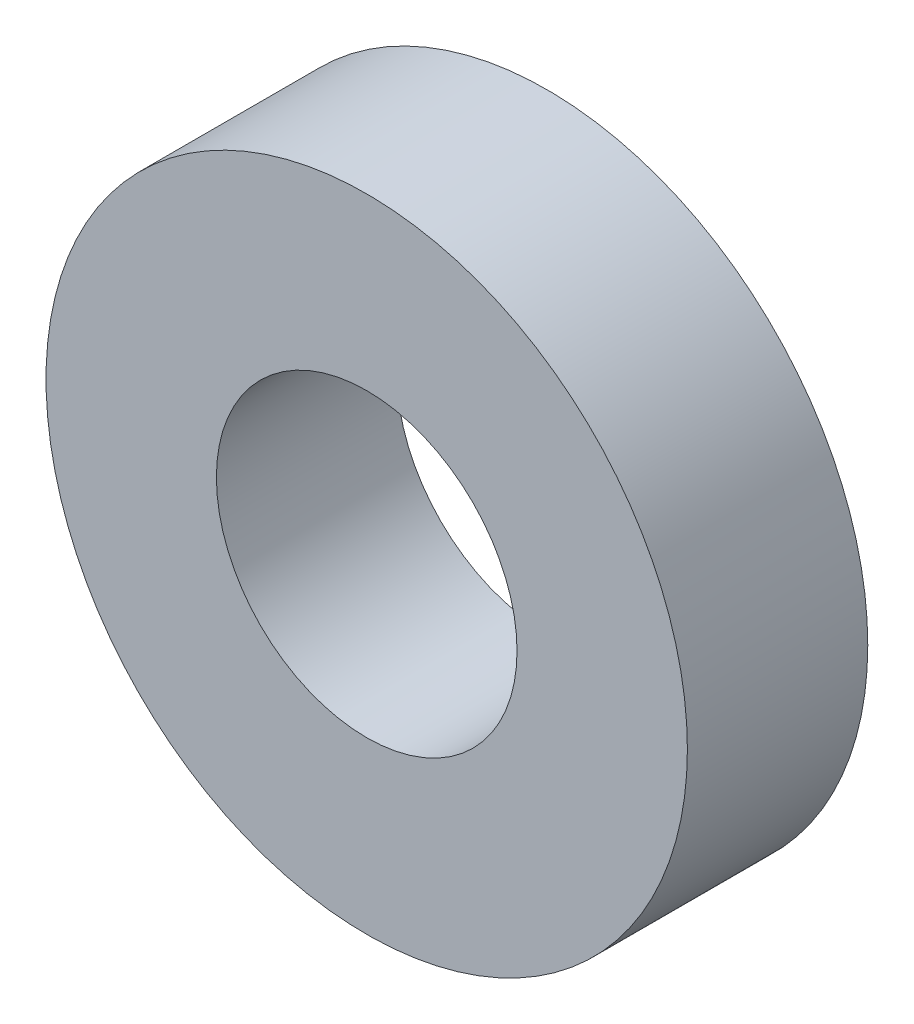
ISO-10303-21;
HEADER;
FILE_DESCRIPTION(('STEP AP214'),'2;1');
FILE_NAME('part.step','',(''),(''),'','','');
FILE_SCHEMA(('AUTOMOTIVE_DESIGN { 1 0 10303 214 1 1 1 1 }'));
ENDSEC;
DATA;
#1=APPLICATION_CONTEXT('core data for automotive mechanical design processes');
#2=APPLICATION_PROTOCOL_DEFINITION('international standard','automotive_design',2000,#1);
#3=PRODUCT_CONTEXT('',#1,'mechanical');
#4=PRODUCT('Part','Part','',(#3));
#5=PRODUCT_RELATED_PRODUCT_CATEGORY('part','',(#4));
#6=PRODUCT_DEFINITION_FORMATION('','',#4);
#7=PRODUCT_DEFINITION_CONTEXT('part definition',#1,'design');
#8=PRODUCT_DEFINITION('design','',#6,#7);
#9=PRODUCT_DEFINITION_SHAPE('','',#8);
#10=(LENGTH_UNIT() NAMED_UNIT(*) SI_UNIT(.MILLI.,.METRE.));
#11=(NAMED_UNIT(*) PLANE_ANGLE_UNIT() SI_UNIT($,.RADIAN.));
#12=(NAMED_UNIT(*) SI_UNIT($,.STERADIAN.) SOLID_ANGLE_UNIT());
#13=UNCERTAINTY_MEASURE_WITH_UNIT(LENGTH_MEASURE(1.E-05),#10,'distance_accuracy_value','');
#14=(GEOMETRIC_REPRESENTATION_CONTEXT(3) GLOBAL_UNCERTAINTY_ASSIGNED_CONTEXT((#13)) GLOBAL_UNIT_ASSIGNED_CONTEXT((#10,
#11,#12)) REPRESENTATION_CONTEXT('',''));
#15=CARTESIAN_POINT('',(0.,0.,0.));
#16=DIRECTION('',(0.,0.,1.));
#17=DIRECTION('',(1.,0.,0.));
#18=AXIS2_PLACEMENT_3D('',#15,#16,#17);
#19=CARTESIAN_POINT('',(0.,0.,9.));
#20=DIRECTION('',(0.,0.,-1.));
#21=DIRECTION('',(-1.,0.,0.));
#22=AXIS2_PLACEMENT_3D('',#19,#20,#21);
#23=CYLINDRICAL_SURFACE('',#22,16.);
#24=CARTESIAN_POINT('',(0.,0.,9.));
#25=DIRECTION('',(0.,0.,1.));
#26=DIRECTION('',(1.,0.,0.));
#27=AXIS2_PLACEMENT_3D('',#24,#25,#26);
#28=CIRCLE('',#27,16.);
#29=CARTESIAN_POINT('',(16.,0.,9.));
#30=VERTEX_POINT('',#29);
#31=EDGE_CURVE('E10',#30,#30,#28,.T.);
#32=ORIENTED_EDGE('',*,*,#31,.F.);
#33=EDGE_LOOP('',(#32));
#34=FACE_BOUND('',#33,.T.);
#35=CARTESIAN_POINT('',(0.,0.,0.));
#36=DIRECTION('',(0.,0.,1.));
#37=DIRECTION('',(1.,0.,0.));
#38=AXIS2_PLACEMENT_3D('',#35,#36,#37);
#39=CIRCLE('',#38,16.);
#40=CARTESIAN_POINT('',(16.,0.,0.));
#41=VERTEX_POINT('',#40);
#42=EDGE_CURVE('E33',#41,#41,#39,.T.);
#43=ORIENTED_EDGE('',*,*,#42,.T.);
#44=EDGE_LOOP('',(#43));
#45=FACE_BOUND('',#44,.T.);
#46=ADVANCED_FACE('F30',(#34,#45),#23,.T.);
#47=CARTESIAN_POINT('',(0.,0.,9.));
#48=DIRECTION('',(0.,0.,1.));
#49=DIRECTION('',(1.,0.,0.));
#50=AXIS2_PLACEMENT_3D('',#47,#48,#49);
#51=PLANE('',#50);
#52=CARTESIAN_POINT('',(0.,0.,9.));
#53=DIRECTION('',(0.,0.,1.));
#54=DIRECTION('',(1.,0.,0.));
#55=AXIS2_PLACEMENT_3D('',#52,#53,#54);
#56=CIRCLE('',#55,7.5);
#57=CARTESIAN_POINT('',(7.5,0.,9.));
#58=VERTEX_POINT('',#57);
#59=EDGE_CURVE('E42',#58,#58,#56,.T.);
#60=ORIENTED_EDGE('',*,*,#59,.F.);
#61=EDGE_LOOP('',(#60));
#62=FACE_BOUND('',#61,.T.);
#63=ORIENTED_EDGE('',*,*,#31,.T.);
#64=EDGE_LOOP('',(#63));
#65=FACE_BOUND('',#64,.T.);
#66=ADVANCED_FACE('F57',(#62,#65),#51,.T.);
#67=CARTESIAN_POINT('',(0.,0.,0.));
#68=DIRECTION('',(0.,0.,1.));
#69=DIRECTION('',(1.,0.,0.));
#70=AXIS2_PLACEMENT_3D('',#67,#68,#69);
#71=PLANE('',#70);
#72=CARTESIAN_POINT('',(0.,0.,0.));
#73=DIRECTION('',(0.,0.,1.));
#74=DIRECTION('',(1.,0.,0.));
#75=AXIS2_PLACEMENT_3D('',#72,#73,#74);
#76=CIRCLE('',#75,7.5);
#77=CARTESIAN_POINT('',(7.5,0.,0.));
#78=VERTEX_POINT('',#77);
#79=EDGE_CURVE('E40',#78,#78,#76,.T.);
#80=ORIENTED_EDGE('',*,*,#79,.T.);
#81=EDGE_LOOP('',(#80));
#82=FACE_BOUND('',#81,.T.);
#83=ORIENTED_EDGE('',*,*,#42,.F.);
#84=EDGE_LOOP('',(#83));
#85=FACE_BOUND('',#84,.T.);
#86=ADVANCED_FACE('F48',(#82,#85),#71,.F.);
#87=CARTESIAN_POINT('',(0.,0.,0.));
#88=DIRECTION('',(0.,0.,1.));
#89=DIRECTION('',(1.,0.,0.));
#90=AXIS2_PLACEMENT_3D('',#87,#88,#89);
#91=CYLINDRICAL_SURFACE('',#90,7.5);
#92=ORIENTED_EDGE('',*,*,#79,.F.);
#93=EDGE_LOOP('',(#92));
#94=FACE_BOUND('',#93,.T.);
#95=ORIENTED_EDGE('',*,*,#59,.T.);
#96=EDGE_LOOP('',(#95));
#97=FACE_BOUND('',#96,.T.);
#98=ADVANCED_FACE('F51',(#94,#97),#91,.F.);
#99=CLOSED_SHELL('',(#46,#66,#86,#98));
#100=MANIFOLD_SOLID_BREP('B2',#99);
#101=ADVANCED_BREP_SHAPE_REPRESENTATION('',(#18,#100),#14);
#102=SHAPE_DEFINITION_REPRESENTATION(#9,#101);
ENDSEC;
END-ISO-10303-21;
